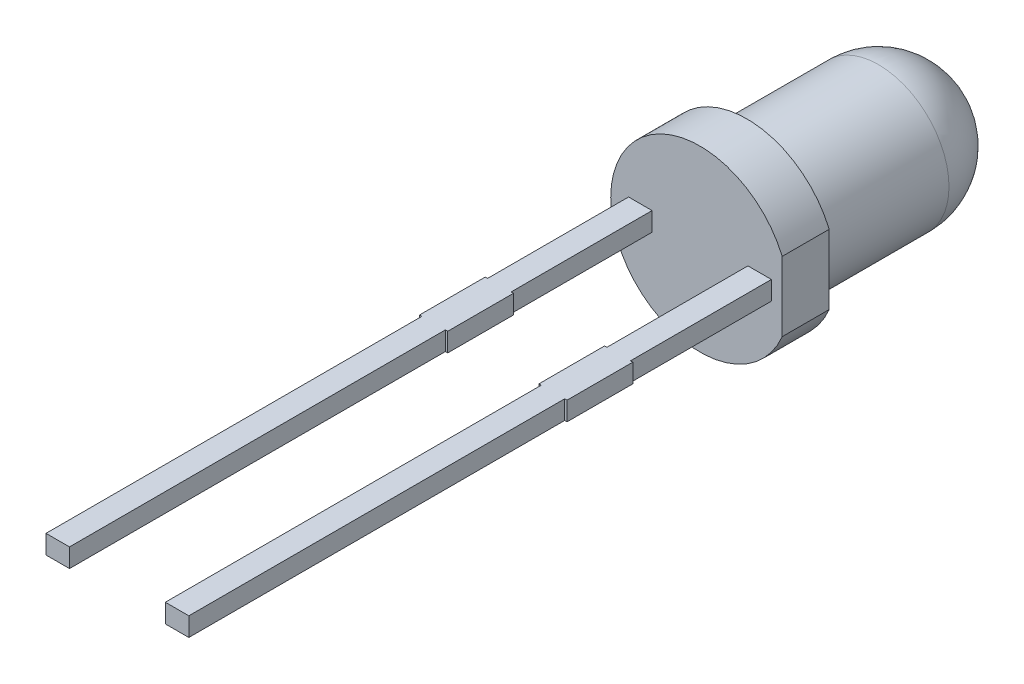
ISO-10303-21;
HEADER;
FILE_DESCRIPTION(('STEP AP214'),'2;1');
FILE_NAME('part.step','',(''),(''),'','','');
FILE_SCHEMA(('AUTOMOTIVE_DESIGN { 1 0 10303 214 1 1 1 1 }'));
ENDSEC;
DATA;
#1=APPLICATION_CONTEXT('core data for automotive mechanical design processes');
#2=APPLICATION_PROTOCOL_DEFINITION('international standard','automotive_design',2000,#1);
#3=PRODUCT_CONTEXT('',#1,'mechanical');
#4=PRODUCT('Part','Part','',(#3));
#5=PRODUCT_RELATED_PRODUCT_CATEGORY('part','',(#4));
#6=PRODUCT_DEFINITION_FORMATION('','',#4);
#7=PRODUCT_DEFINITION_CONTEXT('part definition',#1,'design');
#8=PRODUCT_DEFINITION('design','',#6,#7);
#9=PRODUCT_DEFINITION_SHAPE('','',#8);
#10=(LENGTH_UNIT() NAMED_UNIT(*) SI_UNIT(.MILLI.,.METRE.));
#11=(NAMED_UNIT(*) PLANE_ANGLE_UNIT() SI_UNIT($,.RADIAN.));
#12=(NAMED_UNIT(*) SI_UNIT($,.STERADIAN.) SOLID_ANGLE_UNIT());
#13=UNCERTAINTY_MEASURE_WITH_UNIT(LENGTH_MEASURE(1.E-05),#10,'distance_accuracy_value','');
#14=(GEOMETRIC_REPRESENTATION_CONTEXT(3) GLOBAL_UNCERTAINTY_ASSIGNED_CONTEXT((#13)) GLOBAL_UNIT_ASSIGNED_CONTEXT((#10,
#11,#12)) REPRESENTATION_CONTEXT('',''));
#15=CARTESIAN_POINT('',(0.,0.,0.));
#16=DIRECTION('',(0.,0.,1.));
#17=DIRECTION('',(1.,0.,0.));
#18=AXIS2_PLACEMENT_3D('',#15,#16,#17);
#19=CARTESIAN_POINT('',(-1.52,-0.2,25.4));
#20=DIRECTION('',(1.,0.,0.));
#21=DIRECTION('',(0.,0.,-1.));
#22=AXIS2_PLACEMENT_3D('',#19,#20,#21);
#23=PLANE('',#22);
#24=DIRECTION('',(0.,-1.,0.));
#25=VECTOR('',#24,1.);
#26=CARTESIAN_POINT('',(-1.52,-0.2,13.4));
#27=LINE('',#26,#25);
#28=CARTESIAN_POINT('',(-1.52,0.2,13.4));
#29=VERTEX_POINT('',#28);
#30=CARTESIAN_POINT('',(-1.52,-0.2,13.4));
#31=VERTEX_POINT('',#30);
#32=EDGE_CURVE('E54',#29,#31,#27,.T.);
#33=ORIENTED_EDGE('',*,*,#32,.F.);
#34=DIRECTION('',(0.,0.,-1.));
#35=VECTOR('',#34,1.);
#36=CARTESIAN_POINT('',(-1.52,0.2,4.));
#37=LINE('',#36,#35);
#38=CARTESIAN_POINT('',(-1.52,0.2,5.4));
#39=VERTEX_POINT('',#38);
#40=EDGE_CURVE('E531',#29,#39,#37,.T.);
#41=ORIENTED_EDGE('',*,*,#40,.T.);
#42=DIRECTION('',(0.,1.,0.));
#43=VECTOR('',#42,1.);
#44=CARTESIAN_POINT('',(-1.52,-0.2,5.4));
#45=LINE('',#44,#43);
#46=CARTESIAN_POINT('',(-1.52,-0.2,5.4));
#47=VERTEX_POINT('',#46);
#48=EDGE_CURVE('E281',#47,#39,#45,.T.);
#49=ORIENTED_EDGE('',*,*,#48,.F.);
#50=DIRECTION('',(0.,0.,1.));
#51=VECTOR('',#50,1.);
#52=CARTESIAN_POINT('',(-1.52,-0.2,4.));
#53=LINE('',#52,#51);
#54=EDGE_CURVE('E361',#47,#31,#53,.T.);
#55=ORIENTED_EDGE('',*,*,#54,.T.);
#56=EDGE_LOOP('',(#33,#41,#49,#55));
#57=FACE_BOUND('',#56,.T.);
#58=ADVANCED_FACE('F39',(#57),#23,.F.);
#59=CARTESIAN_POINT('',(-1.02,-0.2,25.4));
#60=DIRECTION('',(-1.,0.,0.));
#61=DIRECTION('',(0.,0.,1.));
#62=AXIS2_PLACEMENT_3D('',#59,#60,#61);
#63=PLANE('',#62);
#64=DIRECTION('',(0.,1.,0.));
#65=VECTOR('',#64,1.);
#66=CARTESIAN_POINT('',(-1.02,-0.2,13.4));
#67=LINE('',#66,#65);
#68=CARTESIAN_POINT('',(-1.02,-0.2,13.4));
#69=VERTEX_POINT('',#68);
#70=CARTESIAN_POINT('',(-1.02,0.2,13.4));
#71=VERTEX_POINT('',#70);
#72=EDGE_CURVE('E411',#69,#71,#67,.T.);
#73=ORIENTED_EDGE('',*,*,#72,.F.);
#74=DIRECTION('',(0.,0.,1.));
#75=VECTOR('',#74,1.);
#76=CARTESIAN_POINT('',(-1.02,-0.2,4.));
#77=LINE('',#76,#75);
#78=CARTESIAN_POINT('',(-1.02,-0.2,5.4));
#79=VERTEX_POINT('',#78);
#80=EDGE_CURVE('E359',#69,#79,#77,.F.);
#81=ORIENTED_EDGE('',*,*,#80,.T.);
#82=DIRECTION('',(0.,1.,0.));
#83=VECTOR('',#82,1.);
#84=CARTESIAN_POINT('',(-1.02,0.2,5.4));
#85=LINE('',#84,#83);
#86=CARTESIAN_POINT('',(-1.02,0.2,5.4));
#87=VERTEX_POINT('',#86);
#88=EDGE_CURVE('E279',#79,#87,#85,.T.);
#89=ORIENTED_EDGE('',*,*,#88,.T.);
#90=DIRECTION('',(0.,0.,-1.));
#91=VECTOR('',#90,1.);
#92=CARTESIAN_POINT('',(-1.02,0.2,4.));
#93=LINE('',#92,#91);
#94=EDGE_CURVE('E545',#87,#71,#93,.F.);
#95=ORIENTED_EDGE('',*,*,#94,.T.);
#96=EDGE_LOOP('',(#73,#81,#89,#95));
#97=FACE_BOUND('',#96,.T.);
#98=ADVANCED_FACE('F486',(#97),#63,.F.);
#99=CARTESIAN_POINT('',(1.02,-0.2,25.4));
#100=DIRECTION('',(1.,0.,0.));
#101=DIRECTION('',(0.,1.,0.));
#102=AXIS2_PLACEMENT_3D('',#99,#100,#101);
#103=PLANE('',#102);
#104=DIRECTION('',(0.,-1.,0.));
#105=VECTOR('',#104,1.);
#106=CARTESIAN_POINT('',(1.02,-0.2,13.4));
#107=LINE('',#106,#105);
#108=CARTESIAN_POINT('',(1.01999999999999,0.2,13.4));
#109=VERTEX_POINT('',#108);
#110=CARTESIAN_POINT('',(1.02,-0.2,13.4));
#111=VERTEX_POINT('',#110);
#112=EDGE_CURVE('E61',#109,#111,#107,.T.);
#113=ORIENTED_EDGE('',*,*,#112,.F.);
#114=DIRECTION('',(0.,0.,-1.));
#115=VECTOR('',#114,1.);
#116=CARTESIAN_POINT('',(1.02,0.2,4.));
#117=LINE('',#116,#115);
#118=CARTESIAN_POINT('',(1.02,0.2,5.4));
#119=VERTEX_POINT('',#118);
#120=EDGE_CURVE('E401',#109,#119,#117,.T.);
#121=ORIENTED_EDGE('',*,*,#120,.T.);
#122=DIRECTION('',(0.,1.,0.));
#123=VECTOR('',#122,1.);
#124=CARTESIAN_POINT('',(1.02,-0.2,5.4));
#125=LINE('',#124,#123);
#126=CARTESIAN_POINT('',(1.02,-0.2,5.4));
#127=VERTEX_POINT('',#126);
#128=EDGE_CURVE('E264',#127,#119,#125,.T.);
#129=ORIENTED_EDGE('',*,*,#128,.F.);
#130=DIRECTION('',(0.,0.,1.));
#131=VECTOR('',#130,1.);
#132=CARTESIAN_POINT('',(1.02,-0.2,4.));
#133=LINE('',#132,#131);
#134=EDGE_CURVE('E234',#127,#111,#133,.T.);
#135=ORIENTED_EDGE('',*,*,#134,.T.);
#136=EDGE_LOOP('',(#113,#121,#129,#135));
#137=FACE_BOUND('',#136,.T.);
#138=ADVANCED_FACE('F483',(#137),#103,.F.);
#139=CARTESIAN_POINT('',(1.52,-0.2,25.4));
#140=DIRECTION('',(-1.,0.,0.));
#141=DIRECTION('',(0.,-1.,0.));
#142=AXIS2_PLACEMENT_3D('',#139,#140,#141);
#143=PLANE('',#142);
#144=DIRECTION('',(0.,1.,0.));
#145=VECTOR('',#144,1.);
#146=CARTESIAN_POINT('',(1.52,-0.2,13.4));
#147=LINE('',#146,#145);
#148=CARTESIAN_POINT('',(1.52,-0.2,13.4));
#149=VERTEX_POINT('',#148);
#150=CARTESIAN_POINT('',(1.51999999999999,0.2,13.4));
#151=VERTEX_POINT('',#150);
#152=EDGE_CURVE('E216',#149,#151,#147,.T.);
#153=ORIENTED_EDGE('',*,*,#152,.F.);
#154=DIRECTION('',(0.,0.,1.));
#155=VECTOR('',#154,1.);
#156=CARTESIAN_POINT('',(1.52,-0.2,4.));
#157=LINE('',#156,#155);
#158=CARTESIAN_POINT('',(1.52,-0.2,5.4));
#159=VERTEX_POINT('',#158);
#160=EDGE_CURVE('E225',#149,#159,#157,.F.);
#161=ORIENTED_EDGE('',*,*,#160,.T.);
#162=DIRECTION('',(0.,1.,0.));
#163=VECTOR('',#162,1.);
#164=CARTESIAN_POINT('',(1.52,0.2,5.4));
#165=LINE('',#164,#163);
#166=CARTESIAN_POINT('',(1.52,0.2,5.4));
#167=VERTEX_POINT('',#166);
#168=EDGE_CURVE('E262',#167,#159,#165,.F.);
#169=ORIENTED_EDGE('',*,*,#168,.F.);
#170=DIRECTION('',(0.,0.,-1.));
#171=VECTOR('',#170,1.);
#172=CARTESIAN_POINT('',(1.52,0.2,4.));
#173=LINE('',#172,#171);
#174=EDGE_CURVE('E228',#167,#151,#173,.F.);
#175=ORIENTED_EDGE('',*,*,#174,.T.);
#176=EDGE_LOOP('',(#153,#161,#169,#175));
#177=FACE_BOUND('',#176,.T.);
#178=ADVANCED_FACE('F224',(#177),#143,.F.);
#179=CARTESIAN_POINT('',(-1.52,0.2,4.));
#180=DIRECTION('',(0.,-1.,0.));
#181=DIRECTION('',(0.,0.,-1.));
#182=AXIS2_PLACEMENT_3D('',#179,#180,#181);
#183=PLANE('',#182);
#184=DIRECTION('',(-1.,0.,0.));
#185=VECTOR('',#184,1.);
#186=CARTESIAN_POINT('',(-1.52,0.2,13.4));
#187=LINE('',#186,#185);
#188=EDGE_CURVE('E286',#71,#29,#187,.T.);
#189=ORIENTED_EDGE('',*,*,#188,.F.);
#190=ORIENTED_EDGE('',*,*,#94,.F.);
#191=DIRECTION('',(1.,0.,0.));
#192=VECTOR('',#191,1.);
#193=CARTESIAN_POINT('',(-1.52,0.2,5.4));
#194=LINE('',#193,#192);
#195=CARTESIAN_POINT('',(-0.97,0.2,5.4));
#196=VERTEX_POINT('',#195);
#197=EDGE_CURVE('E547',#196,#87,#194,.F.);
#198=ORIENTED_EDGE('',*,*,#197,.F.);
#199=DIRECTION('',(0.,0.,-1.));
#200=VECTOR('',#199,1.);
#201=CARTESIAN_POINT('',(-0.97,0.2,4.));
#202=LINE('',#201,#200);
#203=CARTESIAN_POINT('',(-0.97,0.2,4.));
#204=VERTEX_POINT('',#203);
#205=EDGE_CURVE('E374',#204,#196,#202,.F.);
#206=ORIENTED_EDGE('',*,*,#205,.F.);
#207=DIRECTION('',(1.,0.,0.));
#208=VECTOR('',#207,1.);
#209=CARTESIAN_POINT('',(-1.52,0.2,4.));
#210=LINE('',#209,#208);
#211=CARTESIAN_POINT('',(-1.02,0.2,4.));
#212=VERTEX_POINT('',#211);
#213=EDGE_CURVE('E370',#212,#204,#210,.T.);
#214=ORIENTED_EDGE('',*,*,#213,.F.);
#215=DIRECTION('',(0.,0.,-1.));
#216=VECTOR('',#215,1.);
#217=CARTESIAN_POINT('',(-1.02,0.2,4.));
#218=LINE('',#217,#216);
#219=CARTESIAN_POINT('',(-1.02,0.2,1.));
#220=VERTEX_POINT('',#219);
#221=EDGE_CURVE('E375',#220,#212,#218,.F.);
#222=ORIENTED_EDGE('',*,*,#221,.F.);
#223=DIRECTION('',(1.,0.,0.));
#224=VECTOR('',#223,1.);
#225=CARTESIAN_POINT('',(-1.52,0.2,1.));
#226=LINE('',#225,#224);
#227=CARTESIAN_POINT('',(-1.52,0.2,1.));
#228=VERTEX_POINT('',#227);
#229=EDGE_CURVE('E538',#228,#220,#226,.T.);
#230=ORIENTED_EDGE('',*,*,#229,.F.);
#231=DIRECTION('',(0.,0.,-1.));
#232=VECTOR('',#231,1.);
#233=CARTESIAN_POINT('',(-1.52,0.2,4.));
#234=LINE('',#233,#232);
#235=CARTESIAN_POINT('',(-1.52,0.2,4.));
#236=VERTEX_POINT('',#235);
#237=EDGE_CURVE('E310',#228,#236,#234,.F.);
#238=ORIENTED_EDGE('',*,*,#237,.T.);
#239=DIRECTION('',(-1.,0.,0.));
#240=VECTOR('',#239,1.);
#241=CARTESIAN_POINT('',(-0.97,0.2,4.));
#242=LINE('',#241,#240);
#243=CARTESIAN_POINT('',(-1.57,0.2,4.));
#244=VERTEX_POINT('',#243);
#245=EDGE_CURVE('E536',#244,#236,#242,.F.);
#246=ORIENTED_EDGE('',*,*,#245,.F.);
#247=DIRECTION('',(0.,0.,-1.));
#248=VECTOR('',#247,1.);
#249=CARTESIAN_POINT('',(-1.57,0.2,4.));
#250=LINE('',#249,#248);
#251=CARTESIAN_POINT('',(-1.57,0.2,5.4));
#252=VERTEX_POINT('',#251);
#253=EDGE_CURVE('E530',#252,#244,#250,.T.);
#254=ORIENTED_EDGE('',*,*,#253,.F.);
#255=DIRECTION('',(1.,0.,0.));
#256=VECTOR('',#255,1.);
#257=CARTESIAN_POINT('',(-1.52,0.2,5.4));
#258=LINE('',#257,#256);
#259=EDGE_CURVE('E525',#39,#252,#258,.F.);
#260=ORIENTED_EDGE('',*,*,#259,.F.);
#261=ORIENTED_EDGE('',*,*,#40,.F.);
#262=EDGE_LOOP('',(#189,#190,#198,#206,#214,#222,#230,#238,#246,#254,#260,#261));
#263=FACE_BOUND('',#262,.T.);
#264=ADVANCED_FACE('F464',(#263),#183,.F.);
#265=CARTESIAN_POINT('',(-1.52,-0.2,4.));
#266=DIRECTION('',(0.,1.,0.));
#267=DIRECTION('',(-1.,0.,0.));
#268=AXIS2_PLACEMENT_3D('',#265,#266,#267);
#269=PLANE('',#268);
#270=DIRECTION('',(1.,0.,0.));
#271=VECTOR('',#270,1.);
#272=CARTESIAN_POINT('',(-1.52,-0.2,13.4));
#273=LINE('',#272,#271);
#274=EDGE_CURVE('E409',#31,#69,#273,.T.);
#275=ORIENTED_EDGE('',*,*,#274,.F.);
#276=ORIENTED_EDGE('',*,*,#54,.F.);
#277=DIRECTION('',(-1.,0.,0.));
#278=VECTOR('',#277,1.);
#279=CARTESIAN_POINT('',(-1.52,-0.2,5.4));
#280=LINE('',#279,#278);
#281=CARTESIAN_POINT('',(-1.57,-0.2,5.4));
#282=VERTEX_POINT('',#281);
#283=EDGE_CURVE('E365',#282,#47,#280,.F.);
#284=ORIENTED_EDGE('',*,*,#283,.F.);
#285=DIRECTION('',(0.,0.,1.));
#286=VECTOR('',#285,1.);
#287=CARTESIAN_POINT('',(-1.57,-0.2,4.));
#288=LINE('',#287,#286);
#289=CARTESIAN_POINT('',(-1.57,-0.2,4.));
#290=VERTEX_POINT('',#289);
#291=EDGE_CURVE('E588',#290,#282,#288,.T.);
#292=ORIENTED_EDGE('',*,*,#291,.F.);
#293=DIRECTION('',(-1.,0.,0.));
#294=VECTOR('',#293,1.);
#295=CARTESIAN_POINT('',(-1.52,-0.2,4.));
#296=LINE('',#295,#294);
#297=CARTESIAN_POINT('',(-1.52,-0.2,4.));
#298=VERTEX_POINT('',#297);
#299=EDGE_CURVE('E586',#298,#290,#296,.T.);
#300=ORIENTED_EDGE('',*,*,#299,.F.);
#301=DIRECTION('',(0.,0.,-1.));
#302=VECTOR('',#301,1.);
#303=CARTESIAN_POINT('',(-1.52,-0.2,4.));
#304=LINE('',#303,#302);
#305=CARTESIAN_POINT('',(-1.52,-0.2,1.));
#306=VERTEX_POINT('',#305);
#307=EDGE_CURVE('E582',#298,#306,#304,.T.);
#308=ORIENTED_EDGE('',*,*,#307,.T.);
#309=DIRECTION('',(-1.,0.,0.));
#310=VECTOR('',#309,1.);
#311=CARTESIAN_POINT('',(-1.52,-0.2,1.));
#312=LINE('',#311,#310);
#313=CARTESIAN_POINT('',(-1.02,-0.2,1.));
#314=VERTEX_POINT('',#313);
#315=EDGE_CURVE('E339',#314,#306,#312,.T.);
#316=ORIENTED_EDGE('',*,*,#315,.F.);
#317=DIRECTION('',(0.,0.,1.));
#318=VECTOR('',#317,1.);
#319=CARTESIAN_POINT('',(-1.02,-0.2,4.));
#320=LINE('',#319,#318);
#321=CARTESIAN_POINT('',(-1.02,-0.2,4.));
#322=VERTEX_POINT('',#321);
#323=EDGE_CURVE('E350',#322,#314,#320,.F.);
#324=ORIENTED_EDGE('',*,*,#323,.F.);
#325=DIRECTION('',(-1.,0.,0.));
#326=VECTOR('',#325,1.);
#327=CARTESIAN_POINT('',(-1.52,-0.2,4.));
#328=LINE('',#327,#326);
#329=CARTESIAN_POINT('',(-0.97,-0.2,4.));
#330=VERTEX_POINT('',#329);
#331=EDGE_CURVE('E353',#330,#322,#328,.T.);
#332=ORIENTED_EDGE('',*,*,#331,.F.);
#333=DIRECTION('',(0.,0.,1.));
#334=VECTOR('',#333,1.);
#335=CARTESIAN_POINT('',(-0.97,-0.2,4.));
#336=LINE('',#335,#334);
#337=CARTESIAN_POINT('',(-0.97,-0.2,5.4));
#338=VERTEX_POINT('',#337);
#339=EDGE_CURVE('E355',#338,#330,#336,.F.);
#340=ORIENTED_EDGE('',*,*,#339,.F.);
#341=DIRECTION('',(-1.,0.,0.));
#342=VECTOR('',#341,1.);
#343=CARTESIAN_POINT('',(-1.52,-0.2,5.4));
#344=LINE('',#343,#342);
#345=EDGE_CURVE('E357',#79,#338,#344,.F.);
#346=ORIENTED_EDGE('',*,*,#345,.F.);
#347=ORIENTED_EDGE('',*,*,#80,.F.);
#348=EDGE_LOOP('',(#275,#276,#284,#292,#300,#308,#316,#324,#332,#340,#346,#347));
#349=FACE_BOUND('',#348,.T.);
#350=ADVANCED_FACE('F461',(#349),#269,.F.);
#351=CARTESIAN_POINT('',(1.52,0.2,4.));
#352=DIRECTION('',(0.,-1.,0.));
#353=DIRECTION('',(0.,0.,-1.));
#354=AXIS2_PLACEMENT_3D('',#351,#352,#353);
#355=PLANE('',#354);
#356=DIRECTION('',(-1.,0.,0.));
#357=VECTOR('',#356,1.);
#358=CARTESIAN_POINT('',(1.52,0.2,13.4));
#359=LINE('',#358,#357);
#360=EDGE_CURVE('E407',#151,#109,#359,.T.);
#361=ORIENTED_EDGE('',*,*,#360,.F.);
#362=ORIENTED_EDGE('',*,*,#174,.F.);
#363=DIRECTION('',(1.,0.,0.));
#364=VECTOR('',#363,1.);
#365=CARTESIAN_POINT('',(1.52,0.2,5.4));
#366=LINE('',#365,#364);
#367=CARTESIAN_POINT('',(1.57,0.2,5.4));
#368=VERTEX_POINT('',#367);
#369=EDGE_CURVE('E345',#368,#167,#366,.F.);
#370=ORIENTED_EDGE('',*,*,#369,.F.);
#371=DIRECTION('',(0.,0.,-1.));
#372=VECTOR('',#371,1.);
#373=CARTESIAN_POINT('',(1.57,0.2,4.));
#374=LINE('',#373,#372);
#375=CARTESIAN_POINT('',(1.57,0.2,4.));
#376=VERTEX_POINT('',#375);
#377=EDGE_CURVE('E343',#376,#368,#374,.F.);
#378=ORIENTED_EDGE('',*,*,#377,.F.);
#379=DIRECTION('',(1.,0.,0.));
#380=VECTOR('',#379,1.);
#381=CARTESIAN_POINT('',(1.52,0.2,4.));
#382=LINE('',#381,#380);
#383=CARTESIAN_POINT('',(1.52,0.2,4.));
#384=VERTEX_POINT('',#383);
#385=EDGE_CURVE('E327',#384,#376,#382,.T.);
#386=ORIENTED_EDGE('',*,*,#385,.F.);
#387=DIRECTION('',(0.,0.,-1.));
#388=VECTOR('',#387,1.);
#389=CARTESIAN_POINT('',(1.52,0.2,4.));
#390=LINE('',#389,#388);
#391=CARTESIAN_POINT('',(1.52,0.2,1.));
#392=VERTEX_POINT('',#391);
#393=EDGE_CURVE('E337',#392,#384,#390,.F.);
#394=ORIENTED_EDGE('',*,*,#393,.F.);
#395=DIRECTION('',(1.,0.,0.));
#396=VECTOR('',#395,1.);
#397=CARTESIAN_POINT('',(1.52,0.2,1.));
#398=LINE('',#397,#396);
#399=CARTESIAN_POINT('',(1.02,0.2,1.));
#400=VERTEX_POINT('',#399);
#401=EDGE_CURVE('E386',#400,#392,#398,.T.);
#402=ORIENTED_EDGE('',*,*,#401,.F.);
#403=DIRECTION('',(0.,0.,-1.));
#404=VECTOR('',#403,1.);
#405=CARTESIAN_POINT('',(1.02,0.2,4.));
#406=LINE('',#405,#404);
#407=CARTESIAN_POINT('',(1.02,0.2,4.));
#408=VERTEX_POINT('',#407);
#409=EDGE_CURVE('E580',#400,#408,#406,.F.);
#410=ORIENTED_EDGE('',*,*,#409,.T.);
#411=DIRECTION('',(1.,0.,0.));
#412=VECTOR('',#411,1.);
#413=CARTESIAN_POINT('',(1.57,0.2,4.));
#414=LINE('',#413,#412);
#415=CARTESIAN_POINT('',(0.969999999999997,0.2,4.));
#416=VERTEX_POINT('',#415);
#417=EDGE_CURVE('E393',#408,#416,#414,.F.);
#418=ORIENTED_EDGE('',*,*,#417,.T.);
#419=DIRECTION('',(0.,0.,-1.));
#420=VECTOR('',#419,1.);
#421=CARTESIAN_POINT('',(0.97,0.2,4.));
#422=LINE('',#421,#420);
#423=CARTESIAN_POINT('',(0.969999999999999,0.2,5.4));
#424=VERTEX_POINT('',#423);
#425=EDGE_CURVE('E391',#424,#416,#422,.T.);
#426=ORIENTED_EDGE('',*,*,#425,.F.);
#427=DIRECTION('',(1.,0.,0.));
#428=VECTOR('',#427,1.);
#429=CARTESIAN_POINT('',(1.52,0.2,5.4));
#430=LINE('',#429,#428);
#431=EDGE_CURVE('E395',#119,#424,#430,.F.);
#432=ORIENTED_EDGE('',*,*,#431,.F.);
#433=ORIENTED_EDGE('',*,*,#120,.F.);
#434=EDGE_LOOP('',(#361,#362,#370,#378,#386,#394,#402,#410,#418,#426,#432,#433));
#435=FACE_BOUND('',#434,.T.);
#436=ADVANCED_FACE('F341',(#435),#355,.F.);
#437=CARTESIAN_POINT('',(1.52,-0.2,4.));
#438=DIRECTION('',(0.,1.,0.));
#439=DIRECTION('',(-1.,0.,0.));
#440=AXIS2_PLACEMENT_3D('',#437,#438,#439);
#441=PLANE('',#440);
#442=DIRECTION('',(1.,0.,0.));
#443=VECTOR('',#442,1.);
#444=CARTESIAN_POINT('',(1.52,-0.2,13.4));
#445=LINE('',#444,#443);
#446=EDGE_CURVE('E12',#111,#149,#445,.T.);
#447=ORIENTED_EDGE('',*,*,#446,.F.);
#448=ORIENTED_EDGE('',*,*,#134,.F.);
#449=DIRECTION('',(-1.,0.,0.));
#450=VECTOR('',#449,1.);
#451=CARTESIAN_POINT('',(1.52,-0.2,5.4));
#452=LINE('',#451,#450);
#453=CARTESIAN_POINT('',(0.97,-0.2,5.4));
#454=VERTEX_POINT('',#453);
#455=EDGE_CURVE('E238',#454,#127,#452,.F.);
#456=ORIENTED_EDGE('',*,*,#455,.F.);
#457=DIRECTION('',(0.,0.,1.));
#458=VECTOR('',#457,1.);
#459=CARTESIAN_POINT('',(0.97,-0.2,4.));
#460=LINE('',#459,#458);
#461=CARTESIAN_POINT('',(0.97,-0.2,4.));
#462=VERTEX_POINT('',#461);
#463=EDGE_CURVE('E858',#462,#454,#460,.T.);
#464=ORIENTED_EDGE('',*,*,#463,.F.);
#465=DIRECTION('',(-1.,0.,0.));
#466=VECTOR('',#465,1.);
#467=CARTESIAN_POINT('',(1.52,-0.2,4.));
#468=LINE('',#467,#466);
#469=CARTESIAN_POINT('',(1.02,-0.2,4.));
#470=VERTEX_POINT('',#469);
#471=EDGE_CURVE('E854',#470,#462,#468,.T.);
#472=ORIENTED_EDGE('',*,*,#471,.F.);
#473=DIRECTION('',(0.,0.,-1.));
#474=VECTOR('',#473,1.);
#475=CARTESIAN_POINT('',(1.02,-0.2,4.));
#476=LINE('',#475,#474);
#477=CARTESIAN_POINT('',(1.02,-0.2,1.));
#478=VERTEX_POINT('',#477);
#479=EDGE_CURVE('E571',#470,#478,#476,.T.);
#480=ORIENTED_EDGE('',*,*,#479,.T.);
#481=DIRECTION('',(-1.,0.,0.));
#482=VECTOR('',#481,1.);
#483=CARTESIAN_POINT('',(1.52,-0.2,1.));
#484=LINE('',#483,#482);
#485=CARTESIAN_POINT('',(1.52,-0.2,1.));
#486=VERTEX_POINT('',#485);
#487=EDGE_CURVE('E306',#486,#478,#484,.T.);
#488=ORIENTED_EDGE('',*,*,#487,.F.);
#489=DIRECTION('',(0.,0.,1.));
#490=VECTOR('',#489,1.);
#491=CARTESIAN_POINT('',(1.52,-0.2,4.));
#492=LINE('',#491,#490);
#493=CARTESIAN_POINT('',(1.52,-0.2,4.));
#494=VERTEX_POINT('',#493);
#495=EDGE_CURVE('E311',#494,#486,#492,.F.);
#496=ORIENTED_EDGE('',*,*,#495,.F.);
#497=DIRECTION('',(-1.,0.,0.));
#498=VECTOR('',#497,1.);
#499=CARTESIAN_POINT('',(1.52,-0.2,4.));
#500=LINE('',#499,#498);
#501=CARTESIAN_POINT('',(1.57,-0.2,4.));
#502=VERTEX_POINT('',#501);
#503=EDGE_CURVE('E315',#502,#494,#500,.T.);
#504=ORIENTED_EDGE('',*,*,#503,.F.);
#505=DIRECTION('',(0.,0.,1.));
#506=VECTOR('',#505,1.);
#507=CARTESIAN_POINT('',(1.57,-0.2,4.));
#508=LINE('',#507,#506);
#509=CARTESIAN_POINT('',(1.57,-0.2,5.4));
#510=VERTEX_POINT('',#509);
#511=EDGE_CURVE('E236',#510,#502,#508,.F.);
#512=ORIENTED_EDGE('',*,*,#511,.F.);
#513=DIRECTION('',(-1.,0.,0.));
#514=VECTOR('',#513,1.);
#515=CARTESIAN_POINT('',(1.52,-0.2,5.4));
#516=LINE('',#515,#514);
#517=EDGE_CURVE('E233',#159,#510,#516,.F.);
#518=ORIENTED_EDGE('',*,*,#517,.F.);
#519=ORIENTED_EDGE('',*,*,#160,.F.);
#520=EDGE_LOOP('',(#447,#448,#456,#464,#472,#480,#488,#496,#504,#512,#518,#519));
#521=FACE_BOUND('',#520,.T.);
#522=ADVANCED_FACE('F231',(#521),#441,.F.);
#523=CARTESIAN_POINT('',(-1.57,-0.2,5.4));
#524=DIRECTION('',(1.,0.,0.));
#525=DIRECTION('',(0.,0.,-1.));
#526=AXIS2_PLACEMENT_3D('',#523,#524,#525);
#527=PLANE('',#526);
#528=ORIENTED_EDGE('',*,*,#291,.T.);
#529=DIRECTION('',(0.,1.,0.));
#530=VECTOR('',#529,1.);
#531=CARTESIAN_POINT('',(-1.57,0.2,5.4));
#532=LINE('',#531,#530);
#533=EDGE_CURVE('E284',#282,#252,#532,.T.);
#534=ORIENTED_EDGE('',*,*,#533,.T.);
#535=ORIENTED_EDGE('',*,*,#253,.T.);
#536=DIRECTION('',(0.,1.,0.));
#537=VECTOR('',#536,1.);
#538=CARTESIAN_POINT('',(-1.57,0.2,4.));
#539=LINE('',#538,#537);
#540=EDGE_CURVE('E589',#290,#244,#539,.T.);
#541=ORIENTED_EDGE('',*,*,#540,.F.);
#542=EDGE_LOOP('',(#528,#534,#535,#541));
#543=FACE_BOUND('',#542,.T.);
#544=ADVANCED_FACE('F41',(#543),#527,.F.);
#545=CARTESIAN_POINT('',(-0.97,0.2,5.4));
#546=DIRECTION('',(0.,0.,-1.));
#547=DIRECTION('',(-1.,0.,0.));
#548=AXIS2_PLACEMENT_3D('',#545,#546,#547);
#549=PLANE('',#548);
#550=ORIENTED_EDGE('',*,*,#259,.T.);
#551=ORIENTED_EDGE('',*,*,#533,.F.);
#552=ORIENTED_EDGE('',*,*,#283,.T.);
#553=ORIENTED_EDGE('',*,*,#48,.T.);
#554=EDGE_LOOP('',(#550,#551,#552,#553));
#555=FACE_BOUND('',#554,.T.);
#556=ADVANCED_FACE('F509',(#555),#549,.F.);
#557=CARTESIAN_POINT('',(-0.97,0.2,5.4));
#558=DIRECTION('',(0.,0.,-1.));
#559=DIRECTION('',(-1.,0.,0.));
#560=AXIS2_PLACEMENT_3D('',#557,#558,#559);
#561=PLANE('',#560);
#562=ORIENTED_EDGE('',*,*,#345,.T.);
#563=DIRECTION('',(0.,1.,0.));
#564=VECTOR('',#563,1.);
#565=CARTESIAN_POINT('',(-0.97,-0.2,5.4));
#566=LINE('',#565,#564);
#567=EDGE_CURVE('E277',#338,#196,#566,.T.);
#568=ORIENTED_EDGE('',*,*,#567,.T.);
#569=ORIENTED_EDGE('',*,*,#197,.T.);
#570=ORIENTED_EDGE('',*,*,#88,.F.);
#571=EDGE_LOOP('',(#562,#568,#569,#570));
#572=FACE_BOUND('',#571,.T.);
#573=ADVANCED_FACE('F505',(#572),#561,.F.);
#574=CARTESIAN_POINT('',(-0.97,-0.2,5.4));
#575=DIRECTION('',(-1.,0.,0.));
#576=DIRECTION('',(0.,0.,1.));
#577=AXIS2_PLACEMENT_3D('',#574,#575,#576);
#578=PLANE('',#577);
#579=ORIENTED_EDGE('',*,*,#205,.T.);
#580=ORIENTED_EDGE('',*,*,#567,.F.);
#581=ORIENTED_EDGE('',*,*,#339,.T.);
#582=DIRECTION('',(0.,1.,0.));
#583=VECTOR('',#582,1.);
#584=CARTESIAN_POINT('',(-0.97,0.2,4.));
#585=LINE('',#584,#583);
#586=EDGE_CURVE('E274',#204,#330,#585,.F.);
#587=ORIENTED_EDGE('',*,*,#586,.F.);
#588=EDGE_LOOP('',(#579,#580,#581,#587));
#589=FACE_BOUND('',#588,.T.);
#590=ADVANCED_FACE('F501',(#589),#578,.F.);
#591=CARTESIAN_POINT('',(-0.97,0.2,4.));
#592=DIRECTION('',(0.,0.,-1.));
#593=DIRECTION('',(-1.,0.,0.));
#594=AXIS2_PLACEMENT_3D('',#591,#592,#593);
#595=PLANE('',#594);
#596=ORIENTED_EDGE('',*,*,#213,.T.);
#597=ORIENTED_EDGE('',*,*,#586,.T.);
#598=ORIENTED_EDGE('',*,*,#331,.T.);
#599=DIRECTION('',(0.,1.,0.));
#600=VECTOR('',#599,1.);
#601=CARTESIAN_POINT('',(-1.02,-0.2,4.));
#602=LINE('',#601,#600);
#603=EDGE_CURVE('E272',#322,#212,#602,.T.);
#604=ORIENTED_EDGE('',*,*,#603,.T.);
#605=EDGE_LOOP('',(#596,#597,#598,#604));
#606=FACE_BOUND('',#605,.T.);
#607=ADVANCED_FACE('F498',(#606),#595,.T.);
#608=CARTESIAN_POINT('',(-1.02,-0.2,4.));
#609=DIRECTION('',(-1.,0.,0.));
#610=DIRECTION('',(0.,0.,1.));
#611=AXIS2_PLACEMENT_3D('',#608,#609,#610);
#612=PLANE('',#611);
#613=ORIENTED_EDGE('',*,*,#221,.T.);
#614=ORIENTED_EDGE('',*,*,#603,.F.);
#615=ORIENTED_EDGE('',*,*,#323,.T.);
#616=DIRECTION('',(0.,1.,0.));
#617=VECTOR('',#616,1.);
#618=CARTESIAN_POINT('',(-1.02,-0.2,1.));
#619=LINE('',#618,#617);
#620=EDGE_CURVE('E270',#220,#314,#619,.F.);
#621=ORIENTED_EDGE('',*,*,#620,.F.);
#622=EDGE_LOOP('',(#613,#614,#615,#621));
#623=FACE_BOUND('',#622,.T.);
#624=ADVANCED_FACE('F494',(#623),#612,.F.);
#625=CARTESIAN_POINT('',(0.97,-0.2,5.4));
#626=DIRECTION('',(1.,0.,0.));
#627=DIRECTION('',(0.,1.,0.));
#628=AXIS2_PLACEMENT_3D('',#625,#626,#627);
#629=PLANE('',#628);
#630=ORIENTED_EDGE('',*,*,#463,.T.);
#631=DIRECTION('',(0.,1.,0.));
#632=VECTOR('',#631,1.);
#633=CARTESIAN_POINT('',(0.97,0.2,5.4));
#634=LINE('',#633,#632);
#635=EDGE_CURVE('E267',#424,#454,#634,.F.);
#636=ORIENTED_EDGE('',*,*,#635,.F.);
#637=ORIENTED_EDGE('',*,*,#425,.T.);
#638=DIRECTION('',(0.,1.,0.));
#639=VECTOR('',#638,1.);
#640=CARTESIAN_POINT('',(0.97,0.2,4.));
#641=LINE('',#640,#639);
#642=EDGE_CURVE('E390',#416,#462,#641,.F.);
#643=ORIENTED_EDGE('',*,*,#642,.T.);
#644=EDGE_LOOP('',(#630,#636,#637,#643));
#645=FACE_BOUND('',#644,.T.);
#646=ADVANCED_FACE('F490',(#645),#629,.F.);
#647=CARTESIAN_POINT('',(1.57,0.2,5.4));
#648=DIRECTION('',(0.,0.,1.));
#649=DIRECTION('',(1.,0.,0.));
#650=AXIS2_PLACEMENT_3D('',#647,#648,#649);
#651=PLANE('',#650);
#652=ORIENTED_EDGE('',*,*,#635,.T.);
#653=ORIENTED_EDGE('',*,*,#455,.T.);
#654=ORIENTED_EDGE('',*,*,#128,.T.);
#655=ORIENTED_EDGE('',*,*,#431,.T.);
#656=EDGE_LOOP('',(#652,#653,#654,#655));
#657=FACE_BOUND('',#656,.T.);
#658=ADVANCED_FACE('F480',(#657),#651,.T.);
#659=CARTESIAN_POINT('',(1.57,0.2,5.4));
#660=DIRECTION('',(0.,0.,1.));
#661=DIRECTION('',(1.,0.,0.));
#662=AXIS2_PLACEMENT_3D('',#659,#660,#661);
#663=PLANE('',#662);
#664=DIRECTION('',(0.,-1.,0.));
#665=VECTOR('',#664,1.);
#666=CARTESIAN_POINT('',(1.57,-0.2,5.4));
#667=LINE('',#666,#665);
#668=EDGE_CURVE('E260',#510,#368,#667,.F.);
#669=ORIENTED_EDGE('',*,*,#668,.T.);
#670=ORIENTED_EDGE('',*,*,#369,.T.);
#671=ORIENTED_EDGE('',*,*,#168,.T.);
#672=ORIENTED_EDGE('',*,*,#517,.T.);
#673=EDGE_LOOP('',(#669,#670,#671,#672));
#674=FACE_BOUND('',#673,.T.);
#675=ADVANCED_FACE('F405',(#674),#663,.T.);
#676=CARTESIAN_POINT('',(1.57,-0.2,5.4));
#677=DIRECTION('',(-1.,0.,0.));
#678=DIRECTION('',(0.,-1.,0.));
#679=AXIS2_PLACEMENT_3D('',#676,#677,#678);
#680=PLANE('',#679);
#681=ORIENTED_EDGE('',*,*,#377,.T.);
#682=ORIENTED_EDGE('',*,*,#668,.F.);
#683=ORIENTED_EDGE('',*,*,#511,.T.);
#684=DIRECTION('',(0.,1.,0.));
#685=VECTOR('',#684,1.);
#686=CARTESIAN_POINT('',(1.57,0.2,4.));
#687=LINE('',#686,#685);
#688=EDGE_CURVE('E257',#502,#376,#687,.T.);
#689=ORIENTED_EDGE('',*,*,#688,.T.);
#690=EDGE_LOOP('',(#681,#682,#683,#689));
#691=FACE_BOUND('',#690,.T.);
#692=ADVANCED_FACE('F320',(#691),#680,.F.);
#693=CARTESIAN_POINT('',(1.57,0.2,4.));
#694=DIRECTION('',(0.,0.,1.));
#695=DIRECTION('',(1.,0.,0.));
#696=AXIS2_PLACEMENT_3D('',#693,#694,#695);
#697=PLANE('',#696);
#698=DIRECTION('',(0.,1.,0.));
#699=VECTOR('',#698,1.);
#700=CARTESIAN_POINT('',(1.52,-0.2,4.));
#701=LINE('',#700,#699);
#702=EDGE_CURVE('E252',#494,#384,#701,.T.);
#703=ORIENTED_EDGE('',*,*,#702,.T.);
#704=ORIENTED_EDGE('',*,*,#385,.T.);
#705=ORIENTED_EDGE('',*,*,#688,.F.);
#706=ORIENTED_EDGE('',*,*,#503,.T.);
#707=EDGE_LOOP('',(#703,#704,#705,#706));
#708=FACE_BOUND('',#707,.T.);
#709=ADVANCED_FACE('F324',(#708),#697,.F.);
#710=CARTESIAN_POINT('',(1.52,-0.2,4.));
#711=DIRECTION('',(-1.,0.,0.));
#712=DIRECTION('',(0.,0.,1.));
#713=AXIS2_PLACEMENT_3D('',#710,#711,#712);
#714=PLANE('',#713);
#715=ORIENTED_EDGE('',*,*,#393,.T.);
#716=ORIENTED_EDGE('',*,*,#702,.F.);
#717=ORIENTED_EDGE('',*,*,#495,.T.);
#718=DIRECTION('',(0.,1.,0.));
#719=VECTOR('',#718,1.);
#720=CARTESIAN_POINT('',(1.52,-0.2,1.));
#721=LINE('',#720,#719);
#722=EDGE_CURVE('E256',#392,#486,#721,.F.);
#723=ORIENTED_EDGE('',*,*,#722,.F.);
#724=EDGE_LOOP('',(#715,#716,#717,#723));
#725=FACE_BOUND('',#724,.T.);
#726=ADVANCED_FACE('F334',(#725),#714,.F.);
#727=CARTESIAN_POINT('',(-0.97,0.2,4.));
#728=DIRECTION('',(0.,0.,-1.));
#729=DIRECTION('',(-1.,0.,0.));
#730=AXIS2_PLACEMENT_3D('',#727,#728,#729);
#731=PLANE('',#730);
#732=ORIENTED_EDGE('',*,*,#299,.T.);
#733=ORIENTED_EDGE('',*,*,#540,.T.);
#734=ORIENTED_EDGE('',*,*,#245,.T.);
#735=DIRECTION('',(0.,1.,0.));
#736=VECTOR('',#735,1.);
#737=CARTESIAN_POINT('',(-1.52,-0.2,4.));
#738=LINE('',#737,#736);
#739=EDGE_CURVE('E568',#236,#298,#738,.F.);
#740=ORIENTED_EDGE('',*,*,#739,.T.);
#741=EDGE_LOOP('',(#732,#733,#734,#740));
#742=FACE_BOUND('',#741,.T.);
#743=ADVANCED_FACE('F457',(#742),#731,.T.);
#744=CARTESIAN_POINT('',(1.57,0.2,4.));
#745=DIRECTION('',(0.,0.,1.));
#746=DIRECTION('',(1.,0.,0.));
#747=AXIS2_PLACEMENT_3D('',#744,#745,#746);
#748=PLANE('',#747);
#749=DIRECTION('',(0.,1.,0.));
#750=VECTOR('',#749,1.);
#751=CARTESIAN_POINT('',(1.02,-0.2,4.));
#752=LINE('',#751,#750);
#753=EDGE_CURVE('E575',#408,#470,#752,.F.);
#754=ORIENTED_EDGE('',*,*,#753,.T.);
#755=ORIENTED_EDGE('',*,*,#471,.T.);
#756=ORIENTED_EDGE('',*,*,#642,.F.);
#757=ORIENTED_EDGE('',*,*,#417,.F.);
#758=EDGE_LOOP('',(#754,#755,#756,#757));
#759=FACE_BOUND('',#758,.T.);
#760=ADVANCED_FACE('F451',(#759),#748,.F.);
#761=CARTESIAN_POINT('',(-1.52,-0.2,4.));
#762=DIRECTION('',(1.,0.,0.));
#763=DIRECTION('',(0.,0.,-1.));
#764=AXIS2_PLACEMENT_3D('',#761,#762,#763);
#765=PLANE('',#764);
#766=ORIENTED_EDGE('',*,*,#307,.F.);
#767=ORIENTED_EDGE('',*,*,#739,.F.);
#768=ORIENTED_EDGE('',*,*,#237,.F.);
#769=DIRECTION('',(0.,1.,0.));
#770=VECTOR('',#769,1.);
#771=CARTESIAN_POINT('',(-1.52,0.,1.));
#772=LINE('',#771,#770);
#773=EDGE_CURVE('E567',#306,#228,#772,.T.);
#774=ORIENTED_EDGE('',*,*,#773,.F.);
#775=EDGE_LOOP('',(#766,#767,#768,#774));
#776=FACE_BOUND('',#775,.T.);
#777=ADVANCED_FACE('F447',(#776),#765,.F.);
#778=CARTESIAN_POINT('',(1.02,-0.2,4.));
#779=DIRECTION('',(1.,0.,0.));
#780=DIRECTION('',(0.,0.,-1.));
#781=AXIS2_PLACEMENT_3D('',#778,#779,#780);
#782=PLANE('',#781);
#783=ORIENTED_EDGE('',*,*,#479,.F.);
#784=ORIENTED_EDGE('',*,*,#753,.F.);
#785=ORIENTED_EDGE('',*,*,#409,.F.);
#786=DIRECTION('',(0.,1.,0.));
#787=VECTOR('',#786,1.);
#788=CARTESIAN_POINT('',(1.02,0.,1.));
#789=LINE('',#788,#787);
#790=EDGE_CURVE('E388',#478,#400,#789,.T.);
#791=ORIENTED_EDGE('',*,*,#790,.F.);
#792=EDGE_LOOP('',(#783,#784,#785,#791));
#793=FACE_BOUND('',#792,.T.);
#794=ADVANCED_FACE('F444',(#793),#782,.F.);
#795=CARTESIAN_POINT('',(0.,0.,1.));
#796=DIRECTION('',(0.,0.,1.));
#797=DIRECTION('',(1.,0.,0.));
#798=AXIS2_PLACEMENT_3D('',#795,#796,#797);
#799=PLANE('',#798);
#800=ORIENTED_EDGE('',*,*,#487,.T.);
#801=ORIENTED_EDGE('',*,*,#790,.T.);
#802=ORIENTED_EDGE('',*,*,#401,.T.);
#803=ORIENTED_EDGE('',*,*,#722,.T.);
#804=EDGE_LOOP('',(#800,#801,#802,#803));
#805=FACE_BOUND('',#804,.T.);
#806=CARTESIAN_POINT('',(0.,0.,1.));
#807=DIRECTION('',(0.,0.,-1.));
#808=DIRECTION('',(-1.,0.,0.));
#809=AXIS2_PLACEMENT_3D('',#806,#807,#808);
#810=CIRCLE('',#809,1.9);
#811=CARTESIAN_POINT('',(1.75,-0.739932429347218,1.));
#812=VERTEX_POINT('',#811);
#813=CARTESIAN_POINT('',(1.75000000000008,0.739932429347252,1.));
#814=VERTEX_POINT('',#813);
#815=EDGE_CURVE('E293',#812,#814,#810,.T.);
#816=ORIENTED_EDGE('',*,*,#815,.F.);
#817=DIRECTION('',(0.,1.,0.));
#818=VECTOR('',#817,1.);
#819=CARTESIAN_POINT('',(1.75,0.739932429347,1.));
#820=LINE('',#819,#818);
#821=EDGE_CURVE('E297',#812,#814,#820,.T.);
#822=ORIENTED_EDGE('',*,*,#821,.T.);
#823=EDGE_LOOP('',(#816,#822));
#824=FACE_BOUND('',#823,.T.);
#825=ORIENTED_EDGE('',*,*,#315,.T.);
#826=ORIENTED_EDGE('',*,*,#773,.T.);
#827=ORIENTED_EDGE('',*,*,#229,.T.);
#828=ORIENTED_EDGE('',*,*,#620,.T.);
#829=EDGE_LOOP('',(#825,#826,#827,#828));
#830=FACE_BOUND('',#829,.T.);
#831=ADVANCED_FACE('F383',(#805,#824,#830),#799,.T.);
#832=CARTESIAN_POINT('',(1.75,0.739932429347,1.));
#833=DIRECTION('',(-1.,0.,0.));
#834=DIRECTION('',(0.,0.,1.));
#835=AXIS2_PLACEMENT_3D('',#832,#833,#834);
#836=PLANE('',#835);
#837=DIRECTION('',(0.,0.,-1.));
#838=VECTOR('',#837,1.);
#839=CARTESIAN_POINT('',(1.75000000000016,0.739932429347066,1.));
#840=LINE('',#839,#838);
#841=CARTESIAN_POINT('',(1.75000000000008,0.739932429347252,0.));
#842=VERTEX_POINT('',#841);
#843=EDGE_CURVE('E296',#814,#842,#840,.T.);
#844=ORIENTED_EDGE('',*,*,#843,.F.);
#845=ORIENTED_EDGE('',*,*,#821,.F.);
#846=DIRECTION('',(0.,0.,1.));
#847=VECTOR('',#846,1.);
#848=CARTESIAN_POINT('',(1.75,-0.739932429347,1.));
#849=LINE('',#848,#847);
#850=CARTESIAN_POINT('',(1.75,-0.739932429347218,0.));
#851=VERTEX_POINT('',#850);
#852=EDGE_CURVE('E573',#851,#812,#849,.T.);
#853=ORIENTED_EDGE('',*,*,#852,.F.);
#854=DIRECTION('',(0.,1.,0.));
#855=VECTOR('',#854,1.);
#856=CARTESIAN_POINT('',(1.75,0.,0.));
#857=LINE('',#856,#855);
#858=EDGE_CURVE('E292',#851,#842,#857,.T.);
#859=ORIENTED_EDGE('',*,*,#858,.T.);
#860=EDGE_LOOP('',(#844,#845,#853,#859));
#861=FACE_BOUND('',#860,.T.);
#862=ADVANCED_FACE('F437',(#861),#836,.F.);
#863=CARTESIAN_POINT('',(0.,0.,1.));
#864=DIRECTION('',(0.,0.,-1.));
#865=DIRECTION('',(-1.,0.,0.));
#866=AXIS2_PLACEMENT_3D('',#863,#864,#865);
#867=CYLINDRICAL_SURFACE('',#866,1.9);
#868=ORIENTED_EDGE('',*,*,#843,.T.);
#869=CARTESIAN_POINT('',(0.,0.,0.));
#870=DIRECTION('',(0.,0.,-1.));
#871=DIRECTION('',(-1.,0.,0.));
#872=AXIS2_PLACEMENT_3D('',#869,#870,#871);
#873=CIRCLE('',#872,1.9);
#874=EDGE_CURVE('E290',#842,#851,#873,.F.);
#875=ORIENTED_EDGE('',*,*,#874,.T.);
#876=ORIENTED_EDGE('',*,*,#852,.T.);
#877=ORIENTED_EDGE('',*,*,#815,.T.);
#878=EDGE_LOOP('',(#868,#875,#876,#877));
#879=FACE_BOUND('',#878,.T.);
#880=ADVANCED_FACE('F433',(#879),#867,.T.);
#881=CARTESIAN_POINT('',(0.,0.,0.));
#882=DIRECTION('',(0.,0.,1.));
#883=DIRECTION('',(1.,0.,0.));
#884=AXIS2_PLACEMENT_3D('',#881,#882,#883);
#885=PLANE('',#884);
#886=ORIENTED_EDGE('',*,*,#858,.F.);
#887=ORIENTED_EDGE('',*,*,#874,.F.);
#888=EDGE_LOOP('',(#886,#887));
#889=FACE_BOUND('',#888,.T.);
#890=CARTESIAN_POINT('',(0.,0.,0.));
#891=DIRECTION('',(0.,0.,1.));
#892=DIRECTION('',(1.,0.,0.));
#893=AXIS2_PLACEMENT_3D('',#890,#891,#892);
#894=CIRCLE('',#893,1.5);
#895=CARTESIAN_POINT('',(1.5,0.,0.));
#896=VERTEX_POINT('',#895);
#897=EDGE_CURVE('E47',#896,#896,#894,.F.);
#898=ORIENTED_EDGE('',*,*,#897,.F.);
#899=EDGE_LOOP('',(#898));
#900=FACE_BOUND('',#899,.T.);
#901=ADVANCED_FACE('F428',(#889,#900),#885,.F.);
#902=CARTESIAN_POINT('',(0.,0.,-2.8));
#903=DIRECTION('',(-1.,0.,0.));
#904=DIRECTION('',(0.,0.,-1.));
#905=AXIS2_PLACEMENT_3D('',#902,#903,#904);
#906=SPHERICAL_SURFACE('',#905,1.5);
#907=CARTESIAN_POINT('',(0.,0.,-2.8));
#908=DIRECTION('',(0.,0.,1.));
#909=DIRECTION('',(1.,0.,0.));
#910=AXIS2_PLACEMENT_3D('',#907,#908,#909);
#911=CIRCLE('',#910,1.5);
#912=CARTESIAN_POINT('',(1.5,0.,-2.8));
#913=VERTEX_POINT('',#912);
#914=CARTESIAN_POINT('',(-1.5,0.,-2.8));
#915=VERTEX_POINT('',#914);
#916=EDGE_CURVE('E289',#913,#915,#911,.T.);
#917=ORIENTED_EDGE('',*,*,#916,.F.);
#918=CARTESIAN_POINT('',(0.,0.,-2.8));
#919=DIRECTION('',(0.,0.,1.));
#920=DIRECTION('',(1.,0.,0.));
#921=AXIS2_PLACEMENT_3D('',#918,#919,#920);
#922=CIRCLE('',#921,1.5);
#923=EDGE_CURVE('E291',#915,#913,#922,.T.);
#924=ORIENTED_EDGE('',*,*,#923,.F.);
#925=EDGE_LOOP('',(#917,#924));
#926=FACE_BOUND('',#925,.T.);
#927=ADVANCED_FACE('F423',(#926),#906,.T.);
#928=CARTESIAN_POINT('',(0.,0.,0.));
#929=DIRECTION('',(0.,0.,1.));
#930=DIRECTION('',(1.,0.,0.));
#931=AXIS2_PLACEMENT_3D('',#928,#929,#930);
#932=CYLINDRICAL_SURFACE('',#931,1.5);
#933=ORIENTED_EDGE('',*,*,#897,.T.);
#934=EDGE_LOOP('',(#933));
#935=FACE_BOUND('',#934,.T.);
#936=ORIENTED_EDGE('',*,*,#916,.T.);
#937=ORIENTED_EDGE('',*,*,#923,.T.);
#938=EDGE_LOOP('',(#936,#937));
#939=FACE_BOUND('',#938,.T.);
#940=ADVANCED_FACE('F427',(#935,#939),#932,.T.);
#941=CARTESIAN_POINT('',(0.,0.,13.4));
#942=DIRECTION('',(0.,0.,1.));
#943=DIRECTION('',(1.,0.,0.));
#944=AXIS2_PLACEMENT_3D('',#941,#942,#943);
#945=PLANE('',#944);
#946=ORIENTED_EDGE('',*,*,#360,.T.);
#947=ORIENTED_EDGE('',*,*,#112,.T.);
#948=ORIENTED_EDGE('',*,*,#446,.T.);
#949=ORIENTED_EDGE('',*,*,#152,.T.);
#950=EDGE_LOOP('',(#946,#947,#948,#949));
#951=FACE_BOUND('',#950,.T.);
#952=ADVANCED_FACE('F215',(#951),#945,.T.);
#953=ORIENTED_EDGE('',*,*,#188,.T.);
#954=ORIENTED_EDGE('',*,*,#32,.T.);
#955=ORIENTED_EDGE('',*,*,#274,.T.);
#956=ORIENTED_EDGE('',*,*,#72,.T.);
#957=EDGE_LOOP('',(#953,#954,#955,#956));
#958=FACE_BOUND('',#957,.T.);
#959=ADVANCED_FACE('F594',(#958),#945,.T.);
#960=CLOSED_SHELL('',(#58,#98,#138,#178,#264,#350,#436,#522,#544,#556,#573,#590,#607,#624,#646,
#658,#675,#692,#709,#726,#743,#760,#777,#794,#831,#862,#880,#901,#927,#940,#952,#959));
#961=MANIFOLD_SOLID_BREP('B2',#960);
#962=ADVANCED_BREP_SHAPE_REPRESENTATION('',(#18,#961),#14);
#963=SHAPE_DEFINITION_REPRESENTATION(#9,#962);
ENDSEC;
END-ISO-10303-21;
